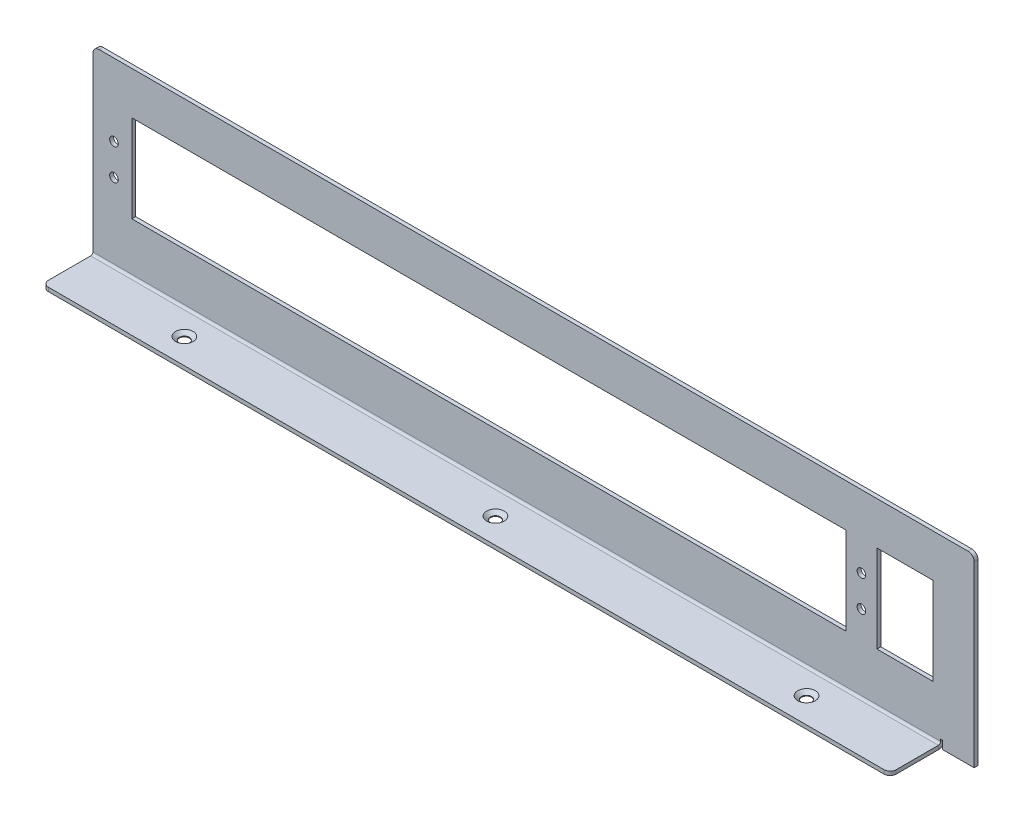
ISO-10303-21;
HEADER;
FILE_DESCRIPTION(('STEP AP214'),'2;1');
FILE_NAME('part.step','',(''),(''),'','','');
FILE_SCHEMA(('AUTOMOTIVE_DESIGN { 1 0 10303 214 1 1 1 1 }'));
ENDSEC;
DATA;
#1=APPLICATION_CONTEXT('core data for automotive mechanical design processes');
#2=APPLICATION_PROTOCOL_DEFINITION('international standard','automotive_design',2000,#1);
#3=PRODUCT_CONTEXT('',#1,'mechanical');
#4=PRODUCT('Part','Part','',(#3));
#5=PRODUCT_RELATED_PRODUCT_CATEGORY('part','',(#4));
#6=PRODUCT_DEFINITION_FORMATION('','',#4);
#7=PRODUCT_DEFINITION_CONTEXT('part definition',#1,'design');
#8=PRODUCT_DEFINITION('design','',#6,#7);
#9=PRODUCT_DEFINITION_SHAPE('','',#8);
#10=(LENGTH_UNIT() NAMED_UNIT(*) SI_UNIT(.MILLI.,.METRE.));
#11=(NAMED_UNIT(*) PLANE_ANGLE_UNIT() SI_UNIT($,.RADIAN.));
#12=(NAMED_UNIT(*) SI_UNIT($,.STERADIAN.) SOLID_ANGLE_UNIT());
#13=UNCERTAINTY_MEASURE_WITH_UNIT(LENGTH_MEASURE(1.E-05),#10,'distance_accuracy_value','');
#14=(GEOMETRIC_REPRESENTATION_CONTEXT(3) GLOBAL_UNCERTAINTY_ASSIGNED_CONTEXT((#13)) GLOBAL_UNIT_ASSIGNED_CONTEXT((#10,
#11,#12)) REPRESENTATION_CONTEXT('',''));
#15=CARTESIAN_POINT('',(0.,0.,0.));
#16=DIRECTION('',(0.,0.,1.));
#17=DIRECTION('',(1.,0.,0.));
#18=AXIS2_PLACEMENT_3D('',#15,#16,#17);
#19=CARTESIAN_POINT('',(-105.79,-28.865,8.25));
#20=DIRECTION('',(0.,1.,0.));
#21=DIRECTION('',(0.,0.,1.));
#22=AXIS2_PLACEMENT_3D('',#19,#20,#21);
#23=CONICAL_SURFACE('',#22,2.8575,0.872664625997166);
#24=CARTESIAN_POINT('',(-105.79,-29.8933585529894,8.25));
#25=DIRECTION('',(0.,1.,0.));
#26=DIRECTION('',(0.,0.,1.));
#27=AXIS2_PLACEMENT_3D('',#24,#25,#26);
#28=CIRCLE('',#27,1.63194999999999);
#29=CARTESIAN_POINT('',(-105.79,-29.8933585529894,9.88194999999999));
#30=VERTEX_POINT('',#29);
#31=EDGE_CURVE('E473',#30,#30,#28,.T.);
#32=ORIENTED_EDGE('',*,*,#31,.F.);
#33=EDGE_LOOP('',(#32));
#34=FACE_BOUND('',#33,.T.);
#35=CARTESIAN_POINT('',(-105.79,-28.865,8.25));
#36=DIRECTION('',(0.,1.,0.));
#37=DIRECTION('',(0.,0.,1.));
#38=AXIS2_PLACEMENT_3D('',#35,#36,#37);
#39=CIRCLE('',#38,2.8575);
#40=CARTESIAN_POINT('',(-105.79,-28.8650000000001,11.1075));
#41=VERTEX_POINT('',#40);
#42=EDGE_CURVE('E465',#41,#41,#39,.T.);
#43=ORIENTED_EDGE('',*,*,#42,.T.);
#44=EDGE_LOOP('',(#43));
#45=FACE_BOUND('',#44,.T.);
#46=ADVANCED_FACE('F68',(#34,#45),#23,.F.);
#47=CARTESIAN_POINT('',(-105.79,-28.865,8.25));
#48=DIRECTION('',(0.,1.,0.));
#49=DIRECTION('',(0.,0.,1.));
#50=AXIS2_PLACEMENT_3D('',#47,#48,#49);
#51=CYLINDRICAL_SURFACE('',#50,1.63194999999999);
#52=CARTESIAN_POINT('',(-105.79,-30.135,8.25));
#53=DIRECTION('',(0.,1.,0.));
#54=DIRECTION('',(0.,0.,1.));
#55=AXIS2_PLACEMENT_3D('',#52,#53,#54);
#56=CIRCLE('',#55,1.63194999999999);
#57=CARTESIAN_POINT('',(-105.79,-30.135,9.88194999999999));
#58=VERTEX_POINT('',#57);
#59=EDGE_CURVE('E469',#58,#58,#56,.T.);
#60=ORIENTED_EDGE('',*,*,#59,.F.);
#61=EDGE_LOOP('',(#60));
#62=FACE_BOUND('',#61,.T.);
#63=ORIENTED_EDGE('',*,*,#31,.T.);
#64=EDGE_LOOP('',(#63));
#65=FACE_BOUND('',#64,.T.);
#66=ADVANCED_FACE('F591',(#62,#65),#51,.F.);
#67=CARTESIAN_POINT('',(143.89,-30.135,-1.27));
#68=DIRECTION('',(0.,-1.,0.));
#69=DIRECTION('',(1.,0.,0.));
#70=AXIS2_PLACEMENT_3D('',#67,#68,#69);
#71=PLANE('',#70);
#72=DIRECTION('',(1.,0.,0.));
#73=VECTOR('',#72,1.);
#74=CARTESIAN_POINT('',(143.89,-30.135,0.));
#75=LINE('',#74,#73);
#76=CARTESIAN_POINT('',(133.605,-30.135,0.));
#77=VERTEX_POINT('',#76);
#78=CARTESIAN_POINT('',(143.89,-30.135,0.));
#79=VERTEX_POINT('',#78);
#80=EDGE_CURVE('E452',#77,#79,#75,.T.);
#81=ORIENTED_EDGE('',*,*,#80,.F.);
#82=DIRECTION('',(0.,0.,-1.));
#83=VECTOR('',#82,1.);
#84=CARTESIAN_POINT('',(133.605,-30.135,0.));
#85=LINE('',#84,#83);
#86=CARTESIAN_POINT('',(133.605,-30.135,-1.27));
#87=VERTEX_POINT('',#86);
#88=EDGE_CURVE('E319',#77,#87,#85,.T.);
#89=ORIENTED_EDGE('',*,*,#88,.T.);
#90=DIRECTION('',(1.,0.,0.));
#91=VECTOR('',#90,1.);
#92=CARTESIAN_POINT('',(143.89,-30.135,-1.27));
#93=LINE('',#92,#91);
#94=CARTESIAN_POINT('',(143.89,-30.135,-1.27));
#95=VERTEX_POINT('',#94);
#96=EDGE_CURVE('E437',#87,#95,#93,.T.);
#97=ORIENTED_EDGE('',*,*,#96,.T.);
#98=DIRECTION('',(0.,0.,1.));
#99=VECTOR('',#98,1.);
#100=CARTESIAN_POINT('',(143.89,-30.135,-1.27));
#101=LINE('',#100,#99);
#102=EDGE_CURVE('E449',#95,#79,#101,.T.);
#103=ORIENTED_EDGE('',*,*,#102,.T.);
#104=EDGE_LOOP('',(#81,#89,#97,#103));
#105=FACE_BOUND('',#104,.T.);
#106=ADVANCED_FACE('F589',(#105),#71,.T.);
#107=CARTESIAN_POINT('',(0.,0.,-1.27));
#108=DIRECTION('',(0.,0.,-1.));
#109=DIRECTION('',(-1.,0.,0.));
#110=AXIS2_PLACEMENT_3D('',#107,#108,#109);
#111=PLANE('',#110);
#112=CARTESIAN_POINT('',(-137.03,6.53500000000001,-1.27));
#113=DIRECTION('',(0.,0.,1.));
#114=DIRECTION('',(1.,0.,0.));
#115=AXIS2_PLACEMENT_3D('',#112,#113,#114);
#116=CIRCLE('',#115,1.40969999999999);
#117=CARTESIAN_POINT('',(-135.6203,6.53500000000001,-1.27));
#118=VERTEX_POINT('',#117);
#119=EDGE_CURVE('E1086',#118,#118,#116,.T.);
#120=ORIENTED_EDGE('',*,*,#119,.T.);
#121=EDGE_LOOP('',(#120));
#122=FACE_BOUND('',#121,.T.);
#123=CARTESIAN_POINT('',(-137.03,-3.62499999999998,-1.27));
#124=DIRECTION('',(0.,0.,1.));
#125=DIRECTION('',(1.,0.,0.));
#126=AXIS2_PLACEMENT_3D('',#123,#124,#125);
#127=CIRCLE('',#126,1.40969999999999);
#128=CARTESIAN_POINT('',(-135.6203,-3.62499999999998,-1.27));
#129=VERTEX_POINT('',#128);
#130=EDGE_CURVE('E1077',#129,#129,#127,.T.);
#131=ORIENTED_EDGE('',*,*,#130,.T.);
#132=EDGE_LOOP('',(#131));
#133=FACE_BOUND('',#132,.T.);
#134=CARTESIAN_POINT('',(107.08,6.53500000000001,-1.27));
#135=DIRECTION('',(0.,0.,1.));
#136=DIRECTION('',(1.,0.,0.));
#137=AXIS2_PLACEMENT_3D('',#134,#135,#136);
#138=CIRCLE('',#137,1.4097);
#139=CARTESIAN_POINT('',(108.4897,6.53500000000001,-1.27));
#140=VERTEX_POINT('',#139);
#141=EDGE_CURVE('E1038',#140,#140,#138,.T.);
#142=ORIENTED_EDGE('',*,*,#141,.T.);
#143=EDGE_LOOP('',(#142));
#144=FACE_BOUND('',#143,.T.);
#145=CARTESIAN_POINT('',(107.08,-3.62499999999998,-1.27));
#146=DIRECTION('',(0.,0.,1.));
#147=DIRECTION('',(1.,0.,0.));
#148=AXIS2_PLACEMENT_3D('',#145,#146,#147);
#149=CIRCLE('',#148,1.4097);
#150=CARTESIAN_POINT('',(108.4897,-3.62499999999998,-1.27));
#151=VERTEX_POINT('',#150);
#152=EDGE_CURVE('E290',#151,#151,#149,.T.);
#153=ORIENTED_EDGE('',*,*,#152,.T.);
#154=EDGE_LOOP('',(#153));
#155=FACE_BOUND('',#154,.T.);
#156=DIRECTION('',(0.,-1.,0.));
#157=VECTOR('',#156,1.);
#158=CARTESIAN_POINT('',(112.16,16.165,-1.27));
#159=LINE('',#158,#157);
#160=CARTESIAN_POINT('',(112.16,16.165,-1.27));
#161=VERTEX_POINT('',#160);
#162=CARTESIAN_POINT('',(112.16,-12.415,-1.27));
#163=VERTEX_POINT('',#162);
#164=EDGE_CURVE('E346',#161,#163,#159,.T.);
#165=ORIENTED_EDGE('',*,*,#164,.T.);
#166=DIRECTION('',(1.,0.,0.));
#167=VECTOR('',#166,1.);
#168=CARTESIAN_POINT('',(112.16,-12.415,-1.27));
#169=LINE('',#168,#167);
#170=CARTESIAN_POINT('',(130.43,-12.415,-1.27));
#171=VERTEX_POINT('',#170);
#172=EDGE_CURVE('E350',#163,#171,#169,.T.);
#173=ORIENTED_EDGE('',*,*,#172,.T.);
#174=DIRECTION('',(0.,1.,0.));
#175=VECTOR('',#174,1.);
#176=CARTESIAN_POINT('',(130.43,16.165,-1.27));
#177=LINE('',#176,#175);
#178=CARTESIAN_POINT('',(130.43,16.165,-1.27));
#179=VERTEX_POINT('',#178);
#180=EDGE_CURVE('E355',#171,#179,#177,.T.);
#181=ORIENTED_EDGE('',*,*,#180,.T.);
#182=DIRECTION('',(-1.,0.,0.));
#183=VECTOR('',#182,1.);
#184=CARTESIAN_POINT('',(112.16,16.165,-1.27));
#185=LINE('',#184,#183);
#186=EDGE_CURVE('E359',#179,#161,#185,.T.);
#187=ORIENTED_EDGE('',*,*,#186,.T.);
#188=EDGE_LOOP('',(#165,#173,#181,#187));
#189=FACE_BOUND('',#188,.T.);
#190=DIRECTION('',(0.,-1.,0.));
#191=VECTOR('',#190,1.);
#192=CARTESIAN_POINT('',(-131.19,16.165,-1.27));
#193=LINE('',#192,#191);
#194=CARTESIAN_POINT('',(-131.19,16.165,-1.27));
#195=VERTEX_POINT('',#194);
#196=CARTESIAN_POINT('',(-131.19,-12.415,-1.27));
#197=VERTEX_POINT('',#196);
#198=EDGE_CURVE('E390',#195,#197,#193,.T.);
#199=ORIENTED_EDGE('',*,*,#198,.T.);
#200=DIRECTION('',(1.,0.,0.));
#201=VECTOR('',#200,1.);
#202=CARTESIAN_POINT('',(-131.19,-12.415,-1.27));
#203=LINE('',#202,#201);
#204=CARTESIAN_POINT('',(102.,-12.415,-1.27));
#205=VERTEX_POINT('',#204);
#206=EDGE_CURVE('E394',#197,#205,#203,.T.);
#207=ORIENTED_EDGE('',*,*,#206,.T.);
#208=DIRECTION('',(0.,1.,0.));
#209=VECTOR('',#208,1.);
#210=CARTESIAN_POINT('',(102.,16.165,-1.27));
#211=LINE('',#210,#209);
#212=CARTESIAN_POINT('',(102.,16.165,-1.27));
#213=VERTEX_POINT('',#212);
#214=EDGE_CURVE('E399',#205,#213,#211,.T.);
#215=ORIENTED_EDGE('',*,*,#214,.T.);
#216=DIRECTION('',(-1.,0.,0.));
#217=VECTOR('',#216,1.);
#218=CARTESIAN_POINT('',(-131.19,16.165,-1.27));
#219=LINE('',#218,#217);
#220=EDGE_CURVE('E403',#213,#195,#219,.T.);
#221=ORIENTED_EDGE('',*,*,#220,.T.);
#222=EDGE_LOOP('',(#199,#207,#215,#221));
#223=FACE_BOUND('',#222,.T.);
#224=DIRECTION('',(0.,-1.,0.));
#225=VECTOR('',#224,1.);
#226=CARTESIAN_POINT('',(-143.89,30.135,-1.27));
#227=LINE('',#226,#225);
#228=CARTESIAN_POINT('',(-143.89,28.135,-1.27));
#229=VERTEX_POINT('',#228);
#230=CARTESIAN_POINT('',(-143.89,-28.1284,-1.27));
#231=VERTEX_POINT('',#230);
#232=EDGE_CURVE('E434',#229,#231,#227,.T.);
#233=ORIENTED_EDGE('',*,*,#232,.F.);
#234=CARTESIAN_POINT('',(-141.89,28.135,-1.27));
#235=DIRECTION('',(0.,0.,-1.));
#236=DIRECTION('',(-1.,0.,0.));
#237=AXIS2_PLACEMENT_3D('',#234,#235,#236);
#238=CIRCLE('',#237,2.);
#239=CARTESIAN_POINT('',(-141.89,30.135,-1.27));
#240=VERTEX_POINT('',#239);
#241=EDGE_CURVE('E496',#229,#240,#238,.T.);
#242=ORIENTED_EDGE('',*,*,#241,.T.);
#243=DIRECTION('',(-1.,0.,0.));
#244=VECTOR('',#243,1.);
#245=CARTESIAN_POINT('',(143.89,30.135,-1.27));
#246=LINE('',#245,#244);
#247=CARTESIAN_POINT('',(141.89,30.135,-1.27));
#248=VERTEX_POINT('',#247);
#249=EDGE_CURVE('E445',#248,#240,#246,.T.);
#250=ORIENTED_EDGE('',*,*,#249,.F.);
#251=CARTESIAN_POINT('',(141.89,28.135,-1.27));
#252=DIRECTION('',(0.,0.,-1.));
#253=DIRECTION('',(-1.,0.,0.));
#254=AXIS2_PLACEMENT_3D('',#251,#252,#253);
#255=CIRCLE('',#254,2.);
#256=CARTESIAN_POINT('',(143.89,28.135,-1.27));
#257=VERTEX_POINT('',#256);
#258=EDGE_CURVE('E493',#248,#257,#255,.T.);
#259=ORIENTED_EDGE('',*,*,#258,.T.);
#260=DIRECTION('',(0.,1.,0.));
#261=VECTOR('',#260,1.);
#262=CARTESIAN_POINT('',(143.89,30.135,-1.27));
#263=LINE('',#262,#261);
#264=EDGE_CURVE('E441',#95,#257,#263,.T.);
#265=ORIENTED_EDGE('',*,*,#264,.F.);
#266=ORIENTED_EDGE('',*,*,#96,.F.);
#267=DIRECTION('',(0.,1.,0.));
#268=VECTOR('',#267,1.);
#269=CARTESIAN_POINT('',(133.605,0.,-1.27));
#270=LINE('',#269,#268);
#271=CARTESIAN_POINT('',(133.605,-27.4934,-1.27));
#272=VERTEX_POINT('',#271);
#273=EDGE_CURVE('E342',#87,#272,#270,.T.);
#274=ORIENTED_EDGE('',*,*,#273,.T.);
#275=DIRECTION('',(-1.,0.,0.));
#276=VECTOR('',#275,1.);
#277=CARTESIAN_POINT('',(0.,-27.4934,-1.27));
#278=LINE('',#277,#276);
#279=CARTESIAN_POINT('',(132.97,-27.4934,-1.27));
#280=VERTEX_POINT('',#279);
#281=EDGE_CURVE('E339',#272,#280,#278,.T.);
#282=ORIENTED_EDGE('',*,*,#281,.T.);
#283=DIRECTION('',(0.,-1.,0.));
#284=VECTOR('',#283,1.);
#285=CARTESIAN_POINT('',(132.97,0.,-1.27));
#286=LINE('',#285,#284);
#287=CARTESIAN_POINT('',(132.97,-28.1284,-1.26999999999998));
#288=VERTEX_POINT('',#287);
#289=EDGE_CURVE('E318',#280,#288,#286,.T.);
#290=ORIENTED_EDGE('',*,*,#289,.T.);
#291=DIRECTION('',(1.,0.,0.));
#292=VECTOR('',#291,1.);
#293=CARTESIAN_POINT('',(132.97,-28.1284,-1.26999999999998));
#294=LINE('',#293,#292);
#295=EDGE_CURVE('E241',#288,#231,#294,.F.);
#296=ORIENTED_EDGE('',*,*,#295,.T.);
#297=EDGE_LOOP('',(#233,#242,#250,#259,#265,#266,#274,#282,#290,#296));
#298=FACE_BOUND('',#297,.T.);
#299=ADVANCED_FACE('F554',(#122,#133,#144,#155,#189,#223,#298),#111,.T.);
#300=CARTESIAN_POINT('',(0.,0.,0.));
#301=DIRECTION('',(0.,0.,-1.));
#302=DIRECTION('',(-1.,0.,0.));
#303=AXIS2_PLACEMENT_3D('',#300,#301,#302);
#304=PLANE('',#303);
#305=CARTESIAN_POINT('',(-137.03,6.53500000000001,0.));
#306=DIRECTION('',(0.,0.,1.));
#307=DIRECTION('',(1.,0.,0.));
#308=AXIS2_PLACEMENT_3D('',#305,#306,#307);
#309=CIRCLE('',#308,1.40970000000001);
#310=CARTESIAN_POINT('',(-135.6203,6.53500000000001,0.));
#311=VERTEX_POINT('',#310);
#312=EDGE_CURVE('E1024',#311,#311,#309,.T.);
#313=ORIENTED_EDGE('',*,*,#312,.F.);
#314=EDGE_LOOP('',(#313));
#315=FACE_BOUND('',#314,.T.);
#316=CARTESIAN_POINT('',(-137.03,-3.62499999999998,0.));
#317=DIRECTION('',(0.,0.,1.));
#318=DIRECTION('',(1.,0.,0.));
#319=AXIS2_PLACEMENT_3D('',#316,#317,#318);
#320=CIRCLE('',#319,1.40970000000001);
#321=CARTESIAN_POINT('',(-135.6203,-3.62499999999998,0.));
#322=VERTEX_POINT('',#321);
#323=EDGE_CURVE('E1028',#322,#322,#320,.T.);
#324=ORIENTED_EDGE('',*,*,#323,.F.);
#325=EDGE_LOOP('',(#324));
#326=FACE_BOUND('',#325,.T.);
#327=CARTESIAN_POINT('',(107.08,6.53500000000001,0.));
#328=DIRECTION('',(0.,0.,1.));
#329=DIRECTION('',(1.,0.,0.));
#330=AXIS2_PLACEMENT_3D('',#327,#328,#329);
#331=CIRCLE('',#330,1.4097);
#332=CARTESIAN_POINT('',(108.4897,6.53500000000001,0.));
#333=VERTEX_POINT('',#332);
#334=EDGE_CURVE('E1032',#333,#333,#331,.T.);
#335=ORIENTED_EDGE('',*,*,#334,.F.);
#336=EDGE_LOOP('',(#335));
#337=FACE_BOUND('',#336,.T.);
#338=CARTESIAN_POINT('',(107.08,-3.62499999999998,0.));
#339=DIRECTION('',(0.,0.,1.));
#340=DIRECTION('',(1.,0.,0.));
#341=AXIS2_PLACEMENT_3D('',#338,#339,#340);
#342=CIRCLE('',#341,1.4097);
#343=CARTESIAN_POINT('',(108.4897,-3.62499999999998,0.));
#344=VERTEX_POINT('',#343);
#345=EDGE_CURVE('E1035',#344,#344,#342,.T.);
#346=ORIENTED_EDGE('',*,*,#345,.F.);
#347=EDGE_LOOP('',(#346));
#348=FACE_BOUND('',#347,.T.);
#349=DIRECTION('',(1.,0.,0.));
#350=VECTOR('',#349,1.);
#351=CARTESIAN_POINT('',(-131.19,-12.415,0.));
#352=LINE('',#351,#350);
#353=CARTESIAN_POINT('',(-131.19,-12.415,0.));
#354=VERTEX_POINT('',#353);
#355=CARTESIAN_POINT('',(102.,-12.415,0.));
#356=VERTEX_POINT('',#355);
#357=EDGE_CURVE('E410',#354,#356,#352,.T.);
#358=ORIENTED_EDGE('',*,*,#357,.F.);
#359=DIRECTION('',(0.,-1.,0.));
#360=VECTOR('',#359,1.);
#361=CARTESIAN_POINT('',(-131.19,16.165,0.));
#362=LINE('',#361,#360);
#363=CARTESIAN_POINT('',(-131.19,16.165,0.));
#364=VERTEX_POINT('',#363);
#365=EDGE_CURVE('E380',#364,#354,#362,.T.);
#366=ORIENTED_EDGE('',*,*,#365,.F.);
#367=DIRECTION('',(-1.,0.,0.));
#368=VECTOR('',#367,1.);
#369=CARTESIAN_POINT('',(-131.19,16.165,0.));
#370=LINE('',#369,#368);
#371=CARTESIAN_POINT('',(102.,16.165,0.));
#372=VERTEX_POINT('',#371);
#373=EDGE_CURVE('E395',#372,#364,#370,.T.);
#374=ORIENTED_EDGE('',*,*,#373,.F.);
#375=DIRECTION('',(0.,1.,0.));
#376=VECTOR('',#375,1.);
#377=CARTESIAN_POINT('',(102.,16.165,0.));
#378=LINE('',#377,#376);
#379=EDGE_CURVE('E414',#356,#372,#378,.T.);
#380=ORIENTED_EDGE('',*,*,#379,.F.);
#381=EDGE_LOOP('',(#358,#366,#374,#380));
#382=FACE_BOUND('',#381,.T.);
#383=DIRECTION('',(1.,0.,0.));
#384=VECTOR('',#383,1.);
#385=CARTESIAN_POINT('',(112.16,-12.415,0.));
#386=LINE('',#385,#384);
#387=CARTESIAN_POINT('',(112.16,-12.415,0.));
#388=VERTEX_POINT('',#387);
#389=CARTESIAN_POINT('',(130.43,-12.415,0.));
#390=VERTEX_POINT('',#389);
#391=EDGE_CURVE('E366',#388,#390,#386,.T.);
#392=ORIENTED_EDGE('',*,*,#391,.F.);
#393=DIRECTION('',(0.,-1.,0.));
#394=VECTOR('',#393,1.);
#395=CARTESIAN_POINT('',(112.16,16.165,0.));
#396=LINE('',#395,#394);
#397=CARTESIAN_POINT('',(112.16,16.165,0.));
#398=VERTEX_POINT('',#397);
#399=EDGE_CURVE('E345',#398,#388,#396,.T.);
#400=ORIENTED_EDGE('',*,*,#399,.F.);
#401=DIRECTION('',(-1.,0.,0.));
#402=VECTOR('',#401,1.);
#403=CARTESIAN_POINT('',(112.16,16.165,0.));
#404=LINE('',#403,#402);
#405=CARTESIAN_POINT('',(130.43,16.165,0.));
#406=VERTEX_POINT('',#405);
#407=EDGE_CURVE('E351',#406,#398,#404,.T.);
#408=ORIENTED_EDGE('',*,*,#407,.F.);
#409=DIRECTION('',(0.,1.,0.));
#410=VECTOR('',#409,1.);
#411=CARTESIAN_POINT('',(130.43,16.165,0.));
#412=LINE('',#411,#410);
#413=EDGE_CURVE('E370',#390,#406,#412,.T.);
#414=ORIENTED_EDGE('',*,*,#413,.F.);
#415=EDGE_LOOP('',(#392,#400,#408,#414));
#416=FACE_BOUND('',#415,.T.);
#417=DIRECTION('',(-1.,0.,0.));
#418=VECTOR('',#417,1.);
#419=CARTESIAN_POINT('',(143.89,30.135,0.));
#420=LINE('',#419,#418);
#421=CARTESIAN_POINT('',(141.89,30.135,0.));
#422=VERTEX_POINT('',#421);
#423=CARTESIAN_POINT('',(-141.89,30.135,0.));
#424=VERTEX_POINT('',#423);
#425=EDGE_CURVE('E438',#422,#424,#420,.T.);
#426=ORIENTED_EDGE('',*,*,#425,.T.);
#427=CARTESIAN_POINT('',(-141.89,28.135,0.));
#428=DIRECTION('',(0.,0.,-1.));
#429=DIRECTION('',(-1.,0.,0.));
#430=AXIS2_PLACEMENT_3D('',#427,#428,#429);
#431=CIRCLE('',#430,2.);
#432=CARTESIAN_POINT('',(-143.89,28.135,0.));
#433=VERTEX_POINT('',#432);
#434=EDGE_CURVE('E487',#424,#433,#431,.F.);
#435=ORIENTED_EDGE('',*,*,#434,.T.);
#436=DIRECTION('',(0.,-1.,0.));
#437=VECTOR('',#436,1.);
#438=CARTESIAN_POINT('',(-143.89,30.135,0.));
#439=LINE('',#438,#437);
#440=CARTESIAN_POINT('',(-143.89,-28.1284,0.));
#441=VERTEX_POINT('',#440);
#442=EDGE_CURVE('E424',#433,#441,#439,.T.);
#443=ORIENTED_EDGE('',*,*,#442,.T.);
#444=DIRECTION('',(1.,0.,0.));
#445=VECTOR('',#444,1.);
#446=CARTESIAN_POINT('',(132.97,-28.1284,0.));
#447=LINE('',#446,#445);
#448=CARTESIAN_POINT('',(132.97,-28.1284,0.));
#449=VERTEX_POINT('',#448);
#450=EDGE_CURVE('E300',#449,#441,#447,.F.);
#451=ORIENTED_EDGE('',*,*,#450,.F.);
#452=DIRECTION('',(0.,-1.,0.));
#453=VECTOR('',#452,1.);
#454=CARTESIAN_POINT('',(132.97,-27.4934,0.));
#455=LINE('',#454,#453);
#456=CARTESIAN_POINT('',(132.97,-27.4934,0.));
#457=VERTEX_POINT('',#456);
#458=EDGE_CURVE('E325',#457,#449,#455,.T.);
#459=ORIENTED_EDGE('',*,*,#458,.F.);
#460=DIRECTION('',(-1.,0.,0.));
#461=VECTOR('',#460,1.);
#462=CARTESIAN_POINT('',(133.605,-27.4934,0.));
#463=LINE('',#462,#461);
#464=CARTESIAN_POINT('',(133.605,-27.4934,0.));
#465=VERTEX_POINT('',#464);
#466=EDGE_CURVE('E320',#465,#457,#463,.T.);
#467=ORIENTED_EDGE('',*,*,#466,.F.);
#468=DIRECTION('',(0.,1.,0.));
#469=VECTOR('',#468,1.);
#470=CARTESIAN_POINT('',(133.605,-30.135,0.));
#471=LINE('',#470,#469);
#472=EDGE_CURVE('E314',#77,#465,#471,.T.);
#473=ORIENTED_EDGE('',*,*,#472,.F.);
#474=ORIENTED_EDGE('',*,*,#80,.T.);
#475=DIRECTION('',(0.,1.,0.));
#476=VECTOR('',#475,1.);
#477=CARTESIAN_POINT('',(143.89,30.135,0.));
#478=LINE('',#477,#476);
#479=CARTESIAN_POINT('',(143.89,28.135,0.));
#480=VERTEX_POINT('',#479);
#481=EDGE_CURVE('E455',#79,#480,#478,.T.);
#482=ORIENTED_EDGE('',*,*,#481,.T.);
#483=CARTESIAN_POINT('',(141.89,28.135,0.));
#484=DIRECTION('',(0.,0.,-1.));
#485=DIRECTION('',(-1.,0.,0.));
#486=AXIS2_PLACEMENT_3D('',#483,#484,#485);
#487=CIRCLE('',#486,2.);
#488=EDGE_CURVE('E484',#480,#422,#487,.F.);
#489=ORIENTED_EDGE('',*,*,#488,.T.);
#490=EDGE_LOOP('',(#426,#435,#443,#451,#459,#467,#473,#474,#482,#489));
#491=FACE_BOUND('',#490,.T.);
#492=ADVANCED_FACE('F564',(#315,#326,#337,#348,#382,#416,#491),#304,.F.);
#493=CARTESIAN_POINT('',(-143.89,30.135,-1.27));
#494=DIRECTION('',(-1.,0.,0.));
#495=DIRECTION('',(0.,0.,1.));
#496=AXIS2_PLACEMENT_3D('',#493,#494,#495);
#497=PLANE('',#496);
#498=ORIENTED_EDGE('',*,*,#442,.F.);
#499=DIRECTION('',(0.,0.,1.));
#500=VECTOR('',#499,1.);
#501=CARTESIAN_POINT('',(-143.89,28.135,-1.27));
#502=LINE('',#501,#500);
#503=EDGE_CURVE('E490',#433,#229,#502,.F.);
#504=ORIENTED_EDGE('',*,*,#503,.T.);
#505=ORIENTED_EDGE('',*,*,#232,.T.);
#506=DIRECTION('',(0.,0.,-1.));
#507=VECTOR('',#506,1.);
#508=CARTESIAN_POINT('',(-143.89,-28.1284,0.));
#509=LINE('',#508,#507);
#510=EDGE_CURVE('E306',#441,#231,#509,.T.);
#511=ORIENTED_EDGE('',*,*,#510,.F.);
#512=EDGE_LOOP('',(#498,#504,#505,#511));
#513=FACE_BOUND('',#512,.T.);
#514=ADVANCED_FACE('F549',(#513),#497,.T.);
#515=CARTESIAN_POINT('',(143.89,30.135,-1.27));
#516=DIRECTION('',(0.,1.,0.));
#517=DIRECTION('',(-1.,0.,0.));
#518=AXIS2_PLACEMENT_3D('',#515,#516,#517);
#519=PLANE('',#518);
#520=ORIENTED_EDGE('',*,*,#249,.T.);
#521=DIRECTION('',(0.,0.,1.));
#522=VECTOR('',#521,1.);
#523=CARTESIAN_POINT('',(-141.89,30.135,-1.27));
#524=LINE('',#523,#522);
#525=EDGE_CURVE('E480',#240,#424,#524,.T.);
#526=ORIENTED_EDGE('',*,*,#525,.T.);
#527=ORIENTED_EDGE('',*,*,#425,.F.);
#528=DIRECTION('',(0.,0.,1.));
#529=VECTOR('',#528,1.);
#530=CARTESIAN_POINT('',(141.89,30.135,-1.27));
#531=LINE('',#530,#529);
#532=EDGE_CURVE('E477',#422,#248,#531,.F.);
#533=ORIENTED_EDGE('',*,*,#532,.T.);
#534=EDGE_LOOP('',(#520,#526,#527,#533));
#535=FACE_BOUND('',#534,.T.);
#536=ADVANCED_FACE('F561',(#535),#519,.T.);
#537=CARTESIAN_POINT('',(143.89,30.135,-1.27));
#538=DIRECTION('',(1.,0.,0.));
#539=DIRECTION('',(0.,0.,-1.));
#540=AXIS2_PLACEMENT_3D('',#537,#538,#539);
#541=PLANE('',#540);
#542=ORIENTED_EDGE('',*,*,#264,.T.);
#543=DIRECTION('',(0.,0.,1.));
#544=VECTOR('',#543,1.);
#545=CARTESIAN_POINT('',(143.89,28.135,-1.27));
#546=LINE('',#545,#544);
#547=EDGE_CURVE('E499',#257,#480,#546,.T.);
#548=ORIENTED_EDGE('',*,*,#547,.T.);
#549=ORIENTED_EDGE('',*,*,#481,.F.);
#550=ORIENTED_EDGE('',*,*,#102,.F.);
#551=EDGE_LOOP('',(#542,#548,#549,#550));
#552=FACE_BOUND('',#551,.T.);
#553=ADVANCED_FACE('F571',(#552),#541,.T.);
#554=CARTESIAN_POINT('',(-131.19,16.165,-1.27));
#555=DIRECTION('',(-1.,0.,0.));
#556=DIRECTION('',(0.,0.,1.));
#557=AXIS2_PLACEMENT_3D('',#554,#555,#556);
#558=PLANE('',#557);
#559=ORIENTED_EDGE('',*,*,#365,.T.);
#560=DIRECTION('',(0.,0.,1.));
#561=VECTOR('',#560,1.);
#562=CARTESIAN_POINT('',(-131.19,-12.415,-1.27));
#563=LINE('',#562,#561);
#564=EDGE_CURVE('E407',#197,#354,#563,.T.);
#565=ORIENTED_EDGE('',*,*,#564,.F.);
#566=ORIENTED_EDGE('',*,*,#198,.F.);
#567=DIRECTION('',(0.,0.,1.));
#568=VECTOR('',#567,1.);
#569=CARTESIAN_POINT('',(-131.19,16.165,-1.27));
#570=LINE('',#569,#568);
#571=EDGE_CURVE('E421',#195,#364,#570,.T.);
#572=ORIENTED_EDGE('',*,*,#571,.T.);
#573=EDGE_LOOP('',(#559,#565,#566,#572));
#574=FACE_BOUND('',#573,.T.);
#575=ADVANCED_FACE('F934',(#574),#558,.F.);
#576=CARTESIAN_POINT('',(-131.19,16.165,-1.27));
#577=DIRECTION('',(0.,1.,0.));
#578=DIRECTION('',(0.,0.,1.));
#579=AXIS2_PLACEMENT_3D('',#576,#577,#578);
#580=PLANE('',#579);
#581=ORIENTED_EDGE('',*,*,#373,.T.);
#582=ORIENTED_EDGE('',*,*,#571,.F.);
#583=ORIENTED_EDGE('',*,*,#220,.F.);
#584=DIRECTION('',(0.,0.,1.));
#585=VECTOR('',#584,1.);
#586=CARTESIAN_POINT('',(102.,16.165,-1.27));
#587=LINE('',#586,#585);
#588=EDGE_CURVE('E425',#213,#372,#587,.T.);
#589=ORIENTED_EDGE('',*,*,#588,.T.);
#590=EDGE_LOOP('',(#581,#582,#583,#589));
#591=FACE_BOUND('',#590,.T.);
#592=ADVANCED_FACE('F923',(#591),#580,.F.);
#593=CARTESIAN_POINT('',(102.,16.165,-1.27));
#594=DIRECTION('',(1.,0.,0.));
#595=DIRECTION('',(0.,0.,-1.));
#596=AXIS2_PLACEMENT_3D('',#593,#594,#595);
#597=PLANE('',#596);
#598=ORIENTED_EDGE('',*,*,#379,.T.);
#599=ORIENTED_EDGE('',*,*,#588,.F.);
#600=ORIENTED_EDGE('',*,*,#214,.F.);
#601=DIRECTION('',(0.,0.,1.));
#602=VECTOR('',#601,1.);
#603=CARTESIAN_POINT('',(102.,-12.415,-1.27));
#604=LINE('',#603,#602);
#605=EDGE_CURVE('E428',#205,#356,#604,.T.);
#606=ORIENTED_EDGE('',*,*,#605,.T.);
#607=EDGE_LOOP('',(#598,#599,#600,#606));
#608=FACE_BOUND('',#607,.T.);
#609=ADVANCED_FACE('F912',(#608),#597,.F.);
#610=CARTESIAN_POINT('',(-131.19,-12.415,-1.27));
#611=DIRECTION('',(0.,-1.,0.));
#612=DIRECTION('',(0.,0.,-1.));
#613=AXIS2_PLACEMENT_3D('',#610,#611,#612);
#614=PLANE('',#613);
#615=ORIENTED_EDGE('',*,*,#357,.T.);
#616=ORIENTED_EDGE('',*,*,#605,.F.);
#617=ORIENTED_EDGE('',*,*,#206,.F.);
#618=ORIENTED_EDGE('',*,*,#564,.T.);
#619=EDGE_LOOP('',(#615,#616,#617,#618));
#620=FACE_BOUND('',#619,.T.);
#621=ADVANCED_FACE('F901',(#620),#614,.F.);
#622=CARTESIAN_POINT('',(112.16,16.165,-1.27));
#623=DIRECTION('',(-1.,0.,0.));
#624=DIRECTION('',(0.,0.,1.));
#625=AXIS2_PLACEMENT_3D('',#622,#623,#624);
#626=PLANE('',#625);
#627=ORIENTED_EDGE('',*,*,#399,.T.);
#628=DIRECTION('',(0.,0.,1.));
#629=VECTOR('',#628,1.);
#630=CARTESIAN_POINT('',(112.16,-12.415,-1.27));
#631=LINE('',#630,#629);
#632=EDGE_CURVE('E363',#163,#388,#631,.T.);
#633=ORIENTED_EDGE('',*,*,#632,.F.);
#634=ORIENTED_EDGE('',*,*,#164,.F.);
#635=DIRECTION('',(0.,0.,1.));
#636=VECTOR('',#635,1.);
#637=CARTESIAN_POINT('',(112.16,16.165,-1.27));
#638=LINE('',#637,#636);
#639=EDGE_CURVE('E377',#161,#398,#638,.T.);
#640=ORIENTED_EDGE('',*,*,#639,.T.);
#641=EDGE_LOOP('',(#627,#633,#634,#640));
#642=FACE_BOUND('',#641,.T.);
#643=ADVANCED_FACE('F890',(#642),#626,.F.);
#644=CARTESIAN_POINT('',(112.16,16.165,-1.27));
#645=DIRECTION('',(0.,1.,0.));
#646=DIRECTION('',(0.,0.,1.));
#647=AXIS2_PLACEMENT_3D('',#644,#645,#646);
#648=PLANE('',#647);
#649=ORIENTED_EDGE('',*,*,#407,.T.);
#650=ORIENTED_EDGE('',*,*,#639,.F.);
#651=ORIENTED_EDGE('',*,*,#186,.F.);
#652=DIRECTION('',(0.,0.,1.));
#653=VECTOR('',#652,1.);
#654=CARTESIAN_POINT('',(130.43,16.165,-1.27));
#655=LINE('',#654,#653);
#656=EDGE_CURVE('E381',#179,#406,#655,.T.);
#657=ORIENTED_EDGE('',*,*,#656,.T.);
#658=EDGE_LOOP('',(#649,#650,#651,#657));
#659=FACE_BOUND('',#658,.T.);
#660=ADVANCED_FACE('F879',(#659),#648,.F.);
#661=CARTESIAN_POINT('',(130.43,16.165,-1.27));
#662=DIRECTION('',(1.,0.,0.));
#663=DIRECTION('',(0.,0.,-1.));
#664=AXIS2_PLACEMENT_3D('',#661,#662,#663);
#665=PLANE('',#664);
#666=ORIENTED_EDGE('',*,*,#413,.T.);
#667=ORIENTED_EDGE('',*,*,#656,.F.);
#668=ORIENTED_EDGE('',*,*,#180,.F.);
#669=DIRECTION('',(0.,0.,1.));
#670=VECTOR('',#669,1.);
#671=CARTESIAN_POINT('',(130.43,-12.415,-1.27));
#672=LINE('',#671,#670);
#673=EDGE_CURVE('E384',#171,#390,#672,.T.);
#674=ORIENTED_EDGE('',*,*,#673,.T.);
#675=EDGE_LOOP('',(#666,#667,#668,#674));
#676=FACE_BOUND('',#675,.T.);
#677=ADVANCED_FACE('F868',(#676),#665,.F.);
#678=CARTESIAN_POINT('',(112.16,-12.415,-1.27));
#679=DIRECTION('',(0.,-1.,0.));
#680=DIRECTION('',(0.,0.,-1.));
#681=AXIS2_PLACEMENT_3D('',#678,#679,#680);
#682=PLANE('',#681);
#683=ORIENTED_EDGE('',*,*,#391,.T.);
#684=ORIENTED_EDGE('',*,*,#673,.F.);
#685=ORIENTED_EDGE('',*,*,#172,.F.);
#686=ORIENTED_EDGE('',*,*,#632,.T.);
#687=EDGE_LOOP('',(#683,#684,#685,#686));
#688=FACE_BOUND('',#687,.T.);
#689=ADVANCED_FACE('F839',(#688),#682,.F.);
#690=CARTESIAN_POINT('',(133.605,-30.135,0.));
#691=DIRECTION('',(-1.,0.,0.));
#692=DIRECTION('',(0.,0.,1.));
#693=AXIS2_PLACEMENT_3D('',#690,#691,#692);
#694=PLANE('',#693);
#695=ORIENTED_EDGE('',*,*,#273,.F.);
#696=ORIENTED_EDGE('',*,*,#88,.F.);
#697=ORIENTED_EDGE('',*,*,#472,.T.);
#698=DIRECTION('',(0.,0.,-1.));
#699=VECTOR('',#698,1.);
#700=CARTESIAN_POINT('',(133.605,-27.4934,0.));
#701=LINE('',#700,#699);
#702=EDGE_CURVE('E324',#465,#272,#701,.T.);
#703=ORIENTED_EDGE('',*,*,#702,.T.);
#704=EDGE_LOOP('',(#695,#696,#697,#703));
#705=FACE_BOUND('',#704,.T.);
#706=ADVANCED_FACE('F580',(#705),#694,.T.);
#707=CARTESIAN_POINT('',(133.605,-27.4934,0.));
#708=DIRECTION('',(0.,-1.,0.));
#709=DIRECTION('',(0.,0.,-1.));
#710=AXIS2_PLACEMENT_3D('',#707,#708,#709);
#711=PLANE('',#710);
#712=ORIENTED_EDGE('',*,*,#281,.F.);
#713=ORIENTED_EDGE('',*,*,#702,.F.);
#714=ORIENTED_EDGE('',*,*,#466,.T.);
#715=DIRECTION('',(0.,0.,-1.));
#716=VECTOR('',#715,1.);
#717=CARTESIAN_POINT('',(132.97,-27.4934,0.));
#718=LINE('',#717,#716);
#719=EDGE_CURVE('E310',#457,#280,#718,.T.);
#720=ORIENTED_EDGE('',*,*,#719,.T.);
#721=EDGE_LOOP('',(#712,#713,#714,#720));
#722=FACE_BOUND('',#721,.T.);
#723=ADVANCED_FACE('F583',(#722),#711,.T.);
#724=CARTESIAN_POINT('',(132.97,-27.4934,0.));
#725=DIRECTION('',(1.,0.,0.));
#726=DIRECTION('',(0.,0.,-1.));
#727=AXIS2_PLACEMENT_3D('',#724,#725,#726);
#728=PLANE('',#727);
#729=ORIENTED_EDGE('',*,*,#289,.F.);
#730=ORIENTED_EDGE('',*,*,#719,.F.);
#731=ORIENTED_EDGE('',*,*,#458,.T.);
#732=DIRECTION('',(0.,0.,-1.));
#733=VECTOR('',#732,1.);
#734=CARTESIAN_POINT('',(132.97,-28.1284,0.));
#735=LINE('',#734,#733);
#736=EDGE_CURVE('E295',#449,#288,#735,.T.);
#737=ORIENTED_EDGE('',*,*,#736,.T.);
#738=EDGE_LOOP('',(#729,#730,#731,#737));
#739=FACE_BOUND('',#738,.T.);
#740=ADVANCED_FACE('F587',(#739),#728,.T.);
#741=CARTESIAN_POINT('',(-143.89,-28.1284,0.736599999999996));
#742=DIRECTION('',(-1.,0.,0.));
#743=DIRECTION('',(0.,0.,1.));
#744=AXIS2_PLACEMENT_3D('',#741,#742,#743);
#745=PLANE('',#744);
#746=DIRECTION('',(0.,1.,0.));
#747=VECTOR('',#746,1.);
#748=CARTESIAN_POINT('',(-143.89,-30.135,0.736599999999993));
#749=LINE('',#748,#747);
#750=CARTESIAN_POINT('',(-143.89,-28.865,0.736599999999994));
#751=VERTEX_POINT('',#750);
#752=CARTESIAN_POINT('',(-143.89,-30.135,0.736599999999989));
#753=VERTEX_POINT('',#752);
#754=EDGE_CURVE('E286',#751,#753,#749,.F.);
#755=ORIENTED_EDGE('',*,*,#754,.F.);
#756=CARTESIAN_POINT('',(-143.89,-28.1284,0.736599999999996));
#757=DIRECTION('',(1.,0.,0.));
#758=DIRECTION('',(0.,0.,-1.));
#759=AXIS2_PLACEMENT_3D('',#756,#757,#758);
#760=CIRCLE('',#759,0.736600000000014);
#761=EDGE_CURVE('E245',#441,#751,#760,.F.);
#762=ORIENTED_EDGE('',*,*,#761,.F.);
#763=ORIENTED_EDGE('',*,*,#510,.T.);
#764=CARTESIAN_POINT('',(-143.89,-28.1284,0.736599999999996));
#765=DIRECTION('',(1.,0.,0.));
#766=DIRECTION('',(0.,0.,-1.));
#767=AXIS2_PLACEMENT_3D('',#764,#765,#766);
#768=CIRCLE('',#767,2.00660000000001);
#769=EDGE_CURVE('E293',#231,#753,#768,.F.);
#770=ORIENTED_EDGE('',*,*,#769,.T.);
#771=EDGE_LOOP('',(#755,#762,#763,#770));
#772=FACE_BOUND('',#771,.T.);
#773=ADVANCED_FACE('F546',(#772),#745,.T.);
#774=CARTESIAN_POINT('',(132.97,-28.1284,0.736600000000037));
#775=DIRECTION('',(-1.,0.,0.));
#776=DIRECTION('',(0.,0.,1.));
#777=AXIS2_PLACEMENT_3D('',#774,#775,#776);
#778=PLANE('',#777);
#779=CARTESIAN_POINT('',(132.97,-28.1284,0.736600000000037));
#780=DIRECTION('',(1.,0.,0.));
#781=DIRECTION('',(0.,0.,-1.));
#782=AXIS2_PLACEMENT_3D('',#779,#780,#781);
#783=CIRCLE('',#782,0.736600000000014);
#784=CARTESIAN_POINT('',(132.97,-28.865,0.736600000000035));
#785=VERTEX_POINT('',#784);
#786=EDGE_CURVE('E252',#785,#449,#783,.T.);
#787=ORIENTED_EDGE('',*,*,#786,.F.);
#788=DIRECTION('',(0.,1.,0.));
#789=VECTOR('',#788,1.);
#790=CARTESIAN_POINT('',(132.97,-28.865,0.736600000000032));
#791=LINE('',#790,#789);
#792=CARTESIAN_POINT('',(132.97,-30.135,0.736600000000028));
#793=VERTEX_POINT('',#792);
#794=EDGE_CURVE('E249',#785,#793,#791,.F.);
#795=ORIENTED_EDGE('',*,*,#794,.T.);
#796=CARTESIAN_POINT('',(132.97,-28.1284,0.736600000000037));
#797=DIRECTION('',(1.,0.,0.));
#798=DIRECTION('',(0.,0.,-1.));
#799=AXIS2_PLACEMENT_3D('',#796,#797,#798);
#800=CIRCLE('',#799,2.00660000000001);
#801=EDGE_CURVE('E233',#793,#288,#800,.T.);
#802=ORIENTED_EDGE('',*,*,#801,.T.);
#803=ORIENTED_EDGE('',*,*,#736,.F.);
#804=EDGE_LOOP('',(#787,#795,#802,#803));
#805=FACE_BOUND('',#804,.T.);
#806=ADVANCED_FACE('F250',(#805),#778,.F.);
#807=CARTESIAN_POINT('',(132.97,-28.1284,0.736600000000037));
#808=DIRECTION('',(1.,0.,0.));
#809=DIRECTION('',(0.,-1.,0.));
#810=AXIS2_PLACEMENT_3D('',#807,#808,#809);
#811=CYLINDRICAL_SURFACE('',#810,2.00660000000001);
#812=ORIENTED_EDGE('',*,*,#295,.F.);
#813=ORIENTED_EDGE('',*,*,#801,.F.);
#814=DIRECTION('',(1.,0.,0.));
#815=VECTOR('',#814,1.);
#816=CARTESIAN_POINT('',(-143.89,-30.135,0.736599999999993));
#817=LINE('',#816,#815);
#818=EDGE_CURVE('E238',#793,#753,#817,.F.);
#819=ORIENTED_EDGE('',*,*,#818,.T.);
#820=ORIENTED_EDGE('',*,*,#769,.F.);
#821=EDGE_LOOP('',(#812,#813,#819,#820));
#822=FACE_BOUND('',#821,.T.);
#823=ADVANCED_FACE('F235',(#822),#811,.T.);
#824=CARTESIAN_POINT('',(132.97,-28.1284,0.736600000000037));
#825=DIRECTION('',(1.,0.,0.));
#826=DIRECTION('',(0.,-1.,0.));
#827=AXIS2_PLACEMENT_3D('',#824,#825,#826);
#828=CYLINDRICAL_SURFACE('',#827,0.736600000000014);
#829=ORIENTED_EDGE('',*,*,#450,.T.);
#830=ORIENTED_EDGE('',*,*,#761,.T.);
#831=DIRECTION('',(1.,0.,0.));
#832=VECTOR('',#831,1.);
#833=CARTESIAN_POINT('',(-143.89,-28.865,0.736599999999997));
#834=LINE('',#833,#832);
#835=EDGE_CURVE('E255',#751,#785,#834,.T.);
#836=ORIENTED_EDGE('',*,*,#835,.T.);
#837=ORIENTED_EDGE('',*,*,#786,.T.);
#838=EDGE_LOOP('',(#829,#830,#836,#837));
#839=FACE_BOUND('',#838,.T.);
#840=ADVANCED_FACE('F541',(#839),#828,.F.);
#841=CARTESIAN_POINT('',(132.97,-30.1350000000001,16.51));
#842=DIRECTION('',(-1.,0.,0.));
#843=DIRECTION('',(0.,-1.,0.));
#844=AXIS2_PLACEMENT_3D('',#841,#842,#843);
#845=PLANE('',#844);
#846=DIRECTION('',(0.,0.,-1.));
#847=VECTOR('',#846,1.);
#848=CARTESIAN_POINT('',(132.97,-28.8650000000001,16.51));
#849=LINE('',#848,#847);
#850=CARTESIAN_POINT('',(132.97,-28.865,14.51));
#851=VERTEX_POINT('',#850);
#852=EDGE_CURVE('E263',#785,#851,#849,.F.);
#853=ORIENTED_EDGE('',*,*,#852,.T.);
#854=DIRECTION('',(0.,1.,0.));
#855=VECTOR('',#854,1.);
#856=CARTESIAN_POINT('',(132.97,-30.135,14.51));
#857=LINE('',#856,#855);
#858=CARTESIAN_POINT('',(132.97,-30.135,14.51));
#859=VERTEX_POINT('',#858);
#860=EDGE_CURVE('E92',#851,#859,#857,.F.);
#861=ORIENTED_EDGE('',*,*,#860,.T.);
#862=DIRECTION('',(0.,0.,1.));
#863=VECTOR('',#862,1.);
#864=CARTESIAN_POINT('',(132.97,-30.135,-1.05756321963805E-13));
#865=LINE('',#864,#863);
#866=EDGE_CURVE('E259',#793,#859,#865,.T.);
#867=ORIENTED_EDGE('',*,*,#866,.F.);
#868=ORIENTED_EDGE('',*,*,#794,.F.);
#869=EDGE_LOOP('',(#853,#861,#867,#868));
#870=FACE_BOUND('',#869,.T.);
#871=ADVANCED_FACE('F265',(#870),#845,.F.);
#872=CARTESIAN_POINT('',(-143.89,-30.135,0.));
#873=DIRECTION('',(1.,0.,0.));
#874=DIRECTION('',(0.,1.,0.));
#875=AXIS2_PLACEMENT_3D('',#872,#873,#874);
#876=PLANE('',#875);
#877=DIRECTION('',(0.,0.,-1.));
#878=VECTOR('',#877,1.);
#879=CARTESIAN_POINT('',(-143.89,-30.135,-1.05756321963805E-13));
#880=LINE('',#879,#878);
#881=CARTESIAN_POINT('',(-143.89,-30.1350000000001,14.51));
#882=VERTEX_POINT('',#881);
#883=EDGE_CURVE('E261',#882,#753,#880,.T.);
#884=ORIENTED_EDGE('',*,*,#883,.F.);
#885=DIRECTION('',(0.,1.,0.));
#886=VECTOR('',#885,1.);
#887=CARTESIAN_POINT('',(-143.89,-30.1350000000001,14.51));
#888=LINE('',#887,#886);
#889=CARTESIAN_POINT('',(-143.89,-28.8650000000001,14.51));
#890=VERTEX_POINT('',#889);
#891=EDGE_CURVE('E13',#882,#890,#888,.T.);
#892=ORIENTED_EDGE('',*,*,#891,.T.);
#893=DIRECTION('',(0.,0.,1.));
#894=VECTOR('',#893,1.);
#895=CARTESIAN_POINT('',(-143.89,-28.865,0.));
#896=LINE('',#895,#894);
#897=EDGE_CURVE('E268',#890,#751,#896,.F.);
#898=ORIENTED_EDGE('',*,*,#897,.T.);
#899=ORIENTED_EDGE('',*,*,#754,.T.);
#900=EDGE_LOOP('',(#884,#892,#898,#899));
#901=FACE_BOUND('',#900,.T.);
#902=ADVANCED_FACE('F538',(#901),#876,.F.);
#903=CARTESIAN_POINT('',(0.,-30.135,-1.05756321963805E-13));
#904=DIRECTION('',(0.,1.,0.));
#905=DIRECTION('',(0.,0.,1.));
#906=AXIS2_PLACEMENT_3D('',#903,#904,#905);
#907=PLANE('',#906);
#908=CARTESIAN_POINT('',(-4.19,-30.135,8.25));
#909=DIRECTION('',(0.,1.,0.));
#910=DIRECTION('',(0.,0.,1.));
#911=AXIS2_PLACEMENT_3D('',#908,#909,#910);
#912=CIRCLE('',#911,1.63194999999999);
#913=CARTESIAN_POINT('',(-4.19,-30.135,9.88194999999999));
#914=VERTEX_POINT('',#913);
#915=EDGE_CURVE('E1120',#914,#914,#912,.T.);
#916=ORIENTED_EDGE('',*,*,#915,.T.);
#917=EDGE_LOOP('',(#916));
#918=FACE_BOUND('',#917,.T.);
#919=CARTESIAN_POINT('',(97.41,-30.135,8.25));
#920=DIRECTION('',(0.,1.,0.));
#921=DIRECTION('',(0.,0.,1.));
#922=AXIS2_PLACEMENT_3D('',#919,#920,#921);
#923=CIRCLE('',#922,1.63194999999999);
#924=CARTESIAN_POINT('',(97.41,-30.135,9.88194999999999));
#925=VERTEX_POINT('',#924);
#926=EDGE_CURVE('E1096',#925,#925,#923,.T.);
#927=ORIENTED_EDGE('',*,*,#926,.T.);
#928=EDGE_LOOP('',(#927));
#929=FACE_BOUND('',#928,.T.);
#930=ORIENTED_EDGE('',*,*,#866,.T.);
#931=CARTESIAN_POINT('',(130.97,-30.135,14.51));
#932=DIRECTION('',(0.,1.,0.));
#933=DIRECTION('',(0.,0.,1.));
#934=AXIS2_PLACEMENT_3D('',#931,#932,#933);
#935=CIRCLE('',#934,2.);
#936=CARTESIAN_POINT('',(130.97,-30.1350000000001,16.51));
#937=VERTEX_POINT('',#936);
#938=EDGE_CURVE('E77',#859,#937,#935,.F.);
#939=ORIENTED_EDGE('',*,*,#938,.T.);
#940=DIRECTION('',(-1.,0.,0.));
#941=VECTOR('',#940,1.);
#942=CARTESIAN_POINT('',(0.,-30.1350000000001,16.51));
#943=LINE('',#942,#941);
#944=CARTESIAN_POINT('',(-141.89,-30.1350000000001,16.51));
#945=VERTEX_POINT('',#944);
#946=EDGE_CURVE('E267',#937,#945,#943,.T.);
#947=ORIENTED_EDGE('',*,*,#946,.T.);
#948=CARTESIAN_POINT('',(-141.89,-30.1350000000001,14.51));
#949=DIRECTION('',(0.,1.,0.));
#950=DIRECTION('',(0.,0.,1.));
#951=AXIS2_PLACEMENT_3D('',#948,#949,#950);
#952=CIRCLE('',#951,2.);
#953=EDGE_CURVE('E84',#945,#882,#952,.F.);
#954=ORIENTED_EDGE('',*,*,#953,.T.);
#955=ORIENTED_EDGE('',*,*,#883,.T.);
#956=ORIENTED_EDGE('',*,*,#818,.F.);
#957=EDGE_LOOP('',(#930,#939,#947,#954,#955,#956));
#958=FACE_BOUND('',#957,.T.);
#959=ORIENTED_EDGE('',*,*,#59,.T.);
#960=EDGE_LOOP('',(#959));
#961=FACE_BOUND('',#960,.T.);
#962=ADVANCED_FACE('F257',(#918,#929,#958,#961),#907,.F.);
#963=CARTESIAN_POINT('',(0.,-28.865,-1.01322140663474E-13));
#964=DIRECTION('',(0.,1.,0.));
#965=DIRECTION('',(0.,0.,1.));
#966=AXIS2_PLACEMENT_3D('',#963,#964,#965);
#967=PLANE('',#966);
#968=CARTESIAN_POINT('',(-4.19,-28.865,8.25));
#969=DIRECTION('',(0.,1.,0.));
#970=DIRECTION('',(0.,0.,1.));
#971=AXIS2_PLACEMENT_3D('',#968,#969,#970);
#972=CIRCLE('',#971,2.8575);
#973=CARTESIAN_POINT('',(-4.19,-28.865,11.1075));
#974=VERTEX_POINT('',#973);
#975=EDGE_CURVE('E1126',#974,#974,#972,.T.);
#976=ORIENTED_EDGE('',*,*,#975,.F.);
#977=EDGE_LOOP('',(#976));
#978=FACE_BOUND('',#977,.T.);
#979=CARTESIAN_POINT('',(97.41,-28.865,8.25));
#980=DIRECTION('',(0.,1.,0.));
#981=DIRECTION('',(0.,0.,1.));
#982=AXIS2_PLACEMENT_3D('',#979,#980,#981);
#983=CIRCLE('',#982,2.8575);
#984=CARTESIAN_POINT('',(97.41,-28.865,11.1075));
#985=VERTEX_POINT('',#984);
#986=EDGE_CURVE('E1108',#985,#985,#983,.T.);
#987=ORIENTED_EDGE('',*,*,#986,.F.);
#988=EDGE_LOOP('',(#987));
#989=FACE_BOUND('',#988,.T.);
#990=DIRECTION('',(1.,0.,0.));
#991=VECTOR('',#990,1.);
#992=CARTESIAN_POINT('',(-143.89,-28.8650000000001,16.51));
#993=LINE('',#992,#991);
#994=CARTESIAN_POINT('',(130.97,-28.8650000000001,16.51));
#995=VERTEX_POINT('',#994);
#996=CARTESIAN_POINT('',(-141.89,-28.8650000000001,16.51));
#997=VERTEX_POINT('',#996);
#998=EDGE_CURVE('E275',#995,#997,#993,.F.);
#999=ORIENTED_EDGE('',*,*,#998,.F.);
#1000=CARTESIAN_POINT('',(130.97,-28.865,14.51));
#1001=DIRECTION('',(0.,1.,0.));
#1002=DIRECTION('',(0.,0.,1.));
#1003=AXIS2_PLACEMENT_3D('',#1000,#1001,#1002);
#1004=CIRCLE('',#1003,2.);
#1005=EDGE_CURVE('E513',#995,#851,#1004,.T.);
#1006=ORIENTED_EDGE('',*,*,#1005,.T.);
#1007=ORIENTED_EDGE('',*,*,#852,.F.);
#1008=ORIENTED_EDGE('',*,*,#835,.F.);
#1009=ORIENTED_EDGE('',*,*,#897,.F.);
#1010=CARTESIAN_POINT('',(-141.89,-28.8650000000001,14.51));
#1011=DIRECTION('',(0.,1.,0.));
#1012=DIRECTION('',(0.,0.,1.));
#1013=AXIS2_PLACEMENT_3D('',#1010,#1011,#1012);
#1014=CIRCLE('',#1013,2.);
#1015=EDGE_CURVE('E510',#890,#997,#1014,.T.);
#1016=ORIENTED_EDGE('',*,*,#1015,.T.);
#1017=EDGE_LOOP('',(#999,#1006,#1007,#1008,#1009,#1016));
#1018=FACE_BOUND('',#1017,.T.);
#1019=ORIENTED_EDGE('',*,*,#42,.F.);
#1020=EDGE_LOOP('',(#1019));
#1021=FACE_BOUND('',#1020,.T.);
#1022=ADVANCED_FACE('F531',(#978,#989,#1018,#1021),#967,.T.);
#1023=CARTESIAN_POINT('',(-143.89,-30.1350000000001,16.51));
#1024=DIRECTION('',(0.,0.,-1.));
#1025=DIRECTION('',(0.,1.,0.));
#1026=AXIS2_PLACEMENT_3D('',#1023,#1024,#1025);
#1027=PLANE('',#1026);
#1028=ORIENTED_EDGE('',*,*,#946,.F.);
#1029=DIRECTION('',(0.,1.,0.));
#1030=VECTOR('',#1029,1.);
#1031=CARTESIAN_POINT('',(130.97,-30.135,16.51));
#1032=LINE('',#1031,#1030);
#1033=EDGE_CURVE('E506',#937,#995,#1032,.T.);
#1034=ORIENTED_EDGE('',*,*,#1033,.T.);
#1035=ORIENTED_EDGE('',*,*,#998,.T.);
#1036=DIRECTION('',(0.,1.,0.));
#1037=VECTOR('',#1036,1.);
#1038=CARTESIAN_POINT('',(-141.89,-30.1350000000001,16.51));
#1039=LINE('',#1038,#1037);
#1040=EDGE_CURVE('E503',#997,#945,#1039,.F.);
#1041=ORIENTED_EDGE('',*,*,#1040,.T.);
#1042=EDGE_LOOP('',(#1028,#1034,#1035,#1041));
#1043=FACE_BOUND('',#1042,.T.);
#1044=ADVANCED_FACE('F526',(#1043),#1027,.F.);
#1045=CARTESIAN_POINT('',(107.08,-3.62499999999998,0.));
#1046=DIRECTION('',(0.,0.,1.));
#1047=DIRECTION('',(1.,0.,0.));
#1048=AXIS2_PLACEMENT_3D('',#1045,#1046,#1047);
#1049=CYLINDRICAL_SURFACE('',#1048,1.4097);
#1050=ORIENTED_EDGE('',*,*,#152,.F.);
#1051=EDGE_LOOP('',(#1050));
#1052=FACE_BOUND('',#1051,.T.);
#1053=ORIENTED_EDGE('',*,*,#345,.T.);
#1054=EDGE_LOOP('',(#1053));
#1055=FACE_BOUND('',#1054,.T.);
#1056=ADVANCED_FACE('F720',(#1052,#1055),#1049,.F.);
#1057=CARTESIAN_POINT('',(107.08,6.53500000000001,0.));
#1058=DIRECTION('',(0.,0.,1.));
#1059=DIRECTION('',(1.,0.,0.));
#1060=AXIS2_PLACEMENT_3D('',#1057,#1058,#1059);
#1061=CYLINDRICAL_SURFACE('',#1060,1.4097);
#1062=ORIENTED_EDGE('',*,*,#141,.F.);
#1063=EDGE_LOOP('',(#1062));
#1064=FACE_BOUND('',#1063,.T.);
#1065=ORIENTED_EDGE('',*,*,#334,.T.);
#1066=EDGE_LOOP('',(#1065));
#1067=FACE_BOUND('',#1066,.T.);
#1068=ADVANCED_FACE('F710',(#1064,#1067),#1061,.F.);
#1069=CARTESIAN_POINT('',(-137.03,-3.62499999999998,0.));
#1070=DIRECTION('',(0.,0.,1.));
#1071=DIRECTION('',(1.,0.,0.));
#1072=AXIS2_PLACEMENT_3D('',#1069,#1070,#1071);
#1073=CYLINDRICAL_SURFACE('',#1072,1.4097);
#1074=ORIENTED_EDGE('',*,*,#130,.F.);
#1075=EDGE_LOOP('',(#1074));
#1076=FACE_BOUND('',#1075,.T.);
#1077=ORIENTED_EDGE('',*,*,#323,.T.);
#1078=EDGE_LOOP('',(#1077));
#1079=FACE_BOUND('',#1078,.T.);
#1080=ADVANCED_FACE('F700',(#1076,#1079),#1073,.F.);
#1081=CARTESIAN_POINT('',(-137.03,6.53500000000001,0.));
#1082=DIRECTION('',(0.,0.,1.));
#1083=DIRECTION('',(1.,0.,0.));
#1084=AXIS2_PLACEMENT_3D('',#1081,#1082,#1083);
#1085=CYLINDRICAL_SURFACE('',#1084,1.4097);
#1086=ORIENTED_EDGE('',*,*,#119,.F.);
#1087=EDGE_LOOP('',(#1086));
#1088=FACE_BOUND('',#1087,.T.);
#1089=ORIENTED_EDGE('',*,*,#312,.T.);
#1090=EDGE_LOOP('',(#1089));
#1091=FACE_BOUND('',#1090,.T.);
#1092=ADVANCED_FACE('F690',(#1088,#1091),#1085,.F.);
#1093=CARTESIAN_POINT('',(97.41,-28.865,8.25));
#1094=DIRECTION('',(0.,1.,0.));
#1095=DIRECTION('',(0.,0.,1.));
#1096=AXIS2_PLACEMENT_3D('',#1093,#1094,#1095);
#1097=CYLINDRICAL_SURFACE('',#1096,1.63194999999999);
#1098=ORIENTED_EDGE('',*,*,#926,.F.);
#1099=EDGE_LOOP('',(#1098));
#1100=FACE_BOUND('',#1099,.T.);
#1101=CARTESIAN_POINT('',(97.41,-29.8933585529893,8.25));
#1102=DIRECTION('',(0.,1.,0.));
#1103=DIRECTION('',(0.,0.,1.));
#1104=AXIS2_PLACEMENT_3D('',#1101,#1102,#1103);
#1105=CIRCLE('',#1104,1.63194999999999);
#1106=CARTESIAN_POINT('',(97.41,-29.8933585529893,9.88194999999999));
#1107=VERTEX_POINT('',#1106);
#1108=EDGE_CURVE('E1102',#1107,#1107,#1105,.T.);
#1109=ORIENTED_EDGE('',*,*,#1108,.T.);
#1110=EDGE_LOOP('',(#1109));
#1111=FACE_BOUND('',#1110,.T.);
#1112=ADVANCED_FACE('F680',(#1100,#1111),#1097,.F.);
#1113=CARTESIAN_POINT('',(97.41,-28.865,8.25));
#1114=DIRECTION('',(0.,1.,0.));
#1115=DIRECTION('',(0.,0.,1.));
#1116=AXIS2_PLACEMENT_3D('',#1113,#1114,#1115);
#1117=CONICAL_SURFACE('',#1116,2.8575,0.872664625997166);
#1118=ORIENTED_EDGE('',*,*,#1108,.F.);
#1119=EDGE_LOOP('',(#1118));
#1120=FACE_BOUND('',#1119,.T.);
#1121=ORIENTED_EDGE('',*,*,#986,.T.);
#1122=EDGE_LOOP('',(#1121));
#1123=FACE_BOUND('',#1122,.T.);
#1124=ADVANCED_FACE('F663',(#1120,#1123),#1117,.F.);
#1125=CARTESIAN_POINT('',(-4.19,-28.865,8.25));
#1126=DIRECTION('',(0.,1.,0.));
#1127=DIRECTION('',(0.,0.,1.));
#1128=AXIS2_PLACEMENT_3D('',#1125,#1126,#1127);
#1129=CYLINDRICAL_SURFACE('',#1128,1.63194999999999);
#1130=ORIENTED_EDGE('',*,*,#915,.F.);
#1131=EDGE_LOOP('',(#1130));
#1132=FACE_BOUND('',#1131,.T.);
#1133=CARTESIAN_POINT('',(-4.19,-29.8933585529894,8.25));
#1134=DIRECTION('',(0.,1.,0.));
#1135=DIRECTION('',(0.,0.,1.));
#1136=AXIS2_PLACEMENT_3D('',#1133,#1134,#1135);
#1137=CIRCLE('',#1136,1.63194999999999);
#1138=CARTESIAN_POINT('',(-4.19,-29.8933585529894,9.88194999999999));
#1139=VERTEX_POINT('',#1138);
#1140=EDGE_CURVE('E1114',#1139,#1139,#1137,.T.);
#1141=ORIENTED_EDGE('',*,*,#1140,.T.);
#1142=EDGE_LOOP('',(#1141));
#1143=FACE_BOUND('',#1142,.T.);
#1144=ADVANCED_FACE('F652',(#1132,#1143),#1129,.F.);
#1145=CARTESIAN_POINT('',(-4.19,-28.865,8.25));
#1146=DIRECTION('',(0.,1.,0.));
#1147=DIRECTION('',(0.,0.,1.));
#1148=AXIS2_PLACEMENT_3D('',#1145,#1146,#1147);
#1149=CONICAL_SURFACE('',#1148,2.8575,0.872664625997166);
#1150=ORIENTED_EDGE('',*,*,#1140,.F.);
#1151=EDGE_LOOP('',(#1150));
#1152=FACE_BOUND('',#1151,.T.);
#1153=ORIENTED_EDGE('',*,*,#975,.T.);
#1154=EDGE_LOOP('',(#1153));
#1155=FACE_BOUND('',#1154,.T.);
#1156=ADVANCED_FACE('F616',(#1152,#1155),#1149,.F.);
#1157=CARTESIAN_POINT('',(-141.89,28.135,-1.27));
#1158=DIRECTION('',(0.,0.,1.));
#1159=DIRECTION('',(1.,0.,0.));
#1160=AXIS2_PLACEMENT_3D('',#1157,#1158,#1159);
#1161=CYLINDRICAL_SURFACE('',#1160,2.);
#1162=ORIENTED_EDGE('',*,*,#241,.F.);
#1163=ORIENTED_EDGE('',*,*,#503,.F.);
#1164=ORIENTED_EDGE('',*,*,#434,.F.);
#1165=ORIENTED_EDGE('',*,*,#525,.F.);
#1166=EDGE_LOOP('',(#1162,#1163,#1164,#1165));
#1167=FACE_BOUND('',#1166,.T.);
#1168=ADVANCED_FACE('F558',(#1167),#1161,.T.);
#1169=CARTESIAN_POINT('',(141.89,28.135,-1.27));
#1170=DIRECTION('',(0.,0.,1.));
#1171=DIRECTION('',(1.,0.,0.));
#1172=AXIS2_PLACEMENT_3D('',#1169,#1170,#1171);
#1173=CYLINDRICAL_SURFACE('',#1172,2.);
#1174=ORIENTED_EDGE('',*,*,#258,.F.);
#1175=ORIENTED_EDGE('',*,*,#532,.F.);
#1176=ORIENTED_EDGE('',*,*,#488,.F.);
#1177=ORIENTED_EDGE('',*,*,#547,.F.);
#1178=EDGE_LOOP('',(#1174,#1175,#1176,#1177));
#1179=FACE_BOUND('',#1178,.T.);
#1180=ADVANCED_FACE('F569',(#1179),#1173,.T.);
#1181=CARTESIAN_POINT('',(130.97,-30.135,14.51));
#1182=DIRECTION('',(0.,1.,0.));
#1183=DIRECTION('',(0.,0.,1.));
#1184=AXIS2_PLACEMENT_3D('',#1181,#1182,#1183);
#1185=CYLINDRICAL_SURFACE('',#1184,2.);
#1186=ORIENTED_EDGE('',*,*,#938,.F.);
#1187=ORIENTED_EDGE('',*,*,#860,.F.);
#1188=ORIENTED_EDGE('',*,*,#1005,.F.);
#1189=ORIENTED_EDGE('',*,*,#1033,.F.);
#1190=EDGE_LOOP('',(#1186,#1187,#1188,#1189));
#1191=FACE_BOUND('',#1190,.T.);
#1192=ADVANCED_FACE('F529',(#1191),#1185,.T.);
#1193=CARTESIAN_POINT('',(-141.89,-30.1350000000001,14.51));
#1194=DIRECTION('',(0.,1.,0.));
#1195=DIRECTION('',(0.,0.,1.));
#1196=AXIS2_PLACEMENT_3D('',#1193,#1194,#1195);
#1197=CYLINDRICAL_SURFACE('',#1196,2.);
#1198=ORIENTED_EDGE('',*,*,#953,.F.);
#1199=ORIENTED_EDGE('',*,*,#1040,.F.);
#1200=ORIENTED_EDGE('',*,*,#1015,.F.);
#1201=ORIENTED_EDGE('',*,*,#891,.F.);
#1202=EDGE_LOOP('',(#1198,#1199,#1200,#1201));
#1203=FACE_BOUND('',#1202,.T.);
#1204=ADVANCED_FACE('F70',(#1203),#1197,.T.);
#1205=CLOSED_SHELL('',(#46,#66,#106,#299,#492,#514,#536,#553,#575,#592,#609,#621,#643,#660,#677,
#689,#706,#723,#740,#773,#806,#823,#840,#871,#902,#962,#1022,#1044,#1056,#1068,#1080,#1092,
#1112,#1124,#1144,#1156,#1168,#1180,#1192,#1204));
#1206=MANIFOLD_SOLID_BREP('B2',#1205);
#1207=ADVANCED_BREP_SHAPE_REPRESENTATION('',(#18,#1206),#14);
#1208=SHAPE_DEFINITION_REPRESENTATION(#9,#1207);
ENDSEC;
END-ISO-10303-21;
